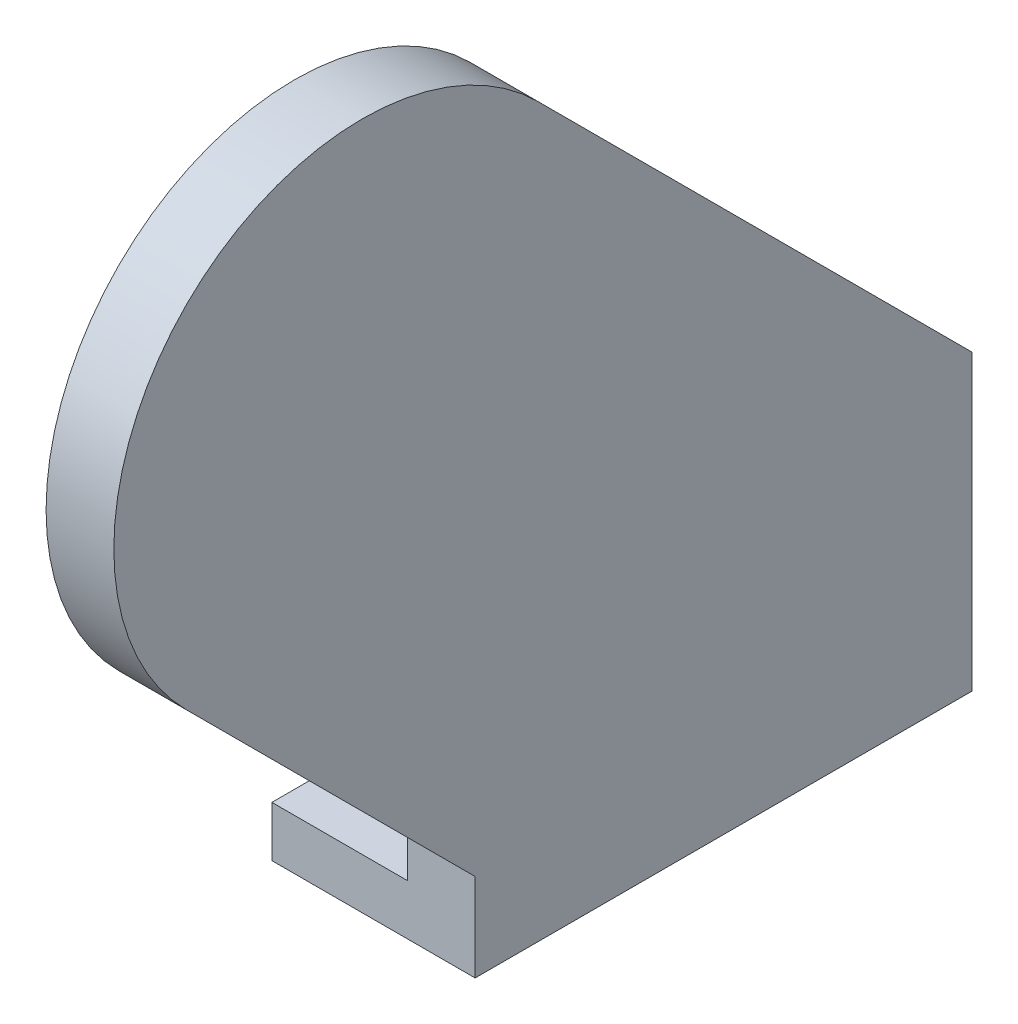
ISO-10303-21;
HEADER;
FILE_DESCRIPTION(('STEP AP214'),'2;1');
FILE_NAME('part.step','',(''),(''),'','','');
FILE_SCHEMA(('AUTOMOTIVE_DESIGN { 1 0 10303 214 1 1 1 1 }'));
ENDSEC;
DATA;
#1=APPLICATION_CONTEXT('core data for automotive mechanical design processes');
#2=APPLICATION_PROTOCOL_DEFINITION('international standard','automotive_design',2000,#1);
#3=PRODUCT_CONTEXT('',#1,'mechanical');
#4=PRODUCT('Part','Part','',(#3));
#5=PRODUCT_RELATED_PRODUCT_CATEGORY('part','',(#4));
#6=PRODUCT_DEFINITION_FORMATION('','',#4);
#7=PRODUCT_DEFINITION_CONTEXT('part definition',#1,'design');
#8=PRODUCT_DEFINITION('design','',#6,#7);
#9=PRODUCT_DEFINITION_SHAPE('','',#8);
#10=(LENGTH_UNIT() NAMED_UNIT(*) SI_UNIT(.MILLI.,.METRE.));
#11=(NAMED_UNIT(*) PLANE_ANGLE_UNIT() SI_UNIT($,.RADIAN.));
#12=(NAMED_UNIT(*) SI_UNIT($,.STERADIAN.) SOLID_ANGLE_UNIT());
#13=UNCERTAINTY_MEASURE_WITH_UNIT(LENGTH_MEASURE(1.E-05),#10,'distance_accuracy_value','');
#14=(GEOMETRIC_REPRESENTATION_CONTEXT(3) GLOBAL_UNCERTAINTY_ASSIGNED_CONTEXT((#13)) GLOBAL_UNIT_ASSIGNED_CONTEXT((#10,
#11,#12)) REPRESENTATION_CONTEXT('',''));
#15=CARTESIAN_POINT('',(0.,0.,0.));
#16=DIRECTION('',(0.,0.,1.));
#17=DIRECTION('',(1.,0.,0.));
#18=AXIS2_PLACEMENT_3D('',#15,#16,#17);
#19=CARTESIAN_POINT('',(61.5,-16.072077939,-4.828427125));
#20=DIRECTION('',(0.,-0.707106781186547,0.707106781186547));
#21=DIRECTION('',(0.,0.707106781186547,0.707106781186547));
#22=AXIS2_PLACEMENT_3D('',#19,#20,#21);
#23=PLANE('',#22);
#24=DIRECTION('',(0.,0.707106781186547,0.707106781186547));
#25=VECTOR('',#24,1.);
#26=CARTESIAN_POINT('',(58.5,-16.072077939,-4.828427125));
#27=LINE('',#26,#25);
#28=CARTESIAN_POINT('',(58.5,-17.243650814,-6.));
#29=VERTEX_POINT('',#28);
#30=CARTESIAN_POINT('',(58.5,1.97817459217873,13.2218254061267));
#31=VERTEX_POINT('',#30);
#32=EDGE_CURVE('E92',#29,#31,#27,.T.);
#33=ORIENTED_EDGE('',*,*,#32,.T.);
#34=DIRECTION('',(-1.,0.,0.));
#35=VECTOR('',#34,1.);
#36=CARTESIAN_POINT('',(60.,1.97817459135746,13.2218254052534));
#37=LINE('',#36,#35);
#38=CARTESIAN_POINT('',(61.5,1.97817459355712,13.2218254061735));
#39=VERTEX_POINT('',#38);
#40=EDGE_CURVE('E255',#31,#39,#37,.F.);
#41=ORIENTED_EDGE('',*,*,#40,.T.);
#42=DIRECTION('',(0.,0.707106781056989,0.707106781316107));
#43=VECTOR('',#42,1.);
#44=CARTESIAN_POINT('',(61.5,-16.0720779385982,-4.828427133876));
#45=LINE('',#44,#43);
#46=CARTESIAN_POINT('',(61.5,-17.243650814,-6.));
#47=VERTEX_POINT('',#46);
#48=EDGE_CURVE('E254',#47,#39,#45,.T.);
#49=ORIENTED_EDGE('',*,*,#48,.F.);
#50=DIRECTION('',(-1.,0.,0.));
#51=VECTOR('',#50,1.);
#52=CARTESIAN_POINT('',(52.5,-17.243650814,-6.));
#53=LINE('',#52,#51);
#54=EDGE_CURVE('E109',#47,#29,#53,.T.);
#55=ORIENTED_EDGE('',*,*,#54,.T.);
#56=EDGE_LOOP('',(#33,#41,#49,#55));
#57=FACE_BOUND('',#56,.T.);
#58=ADVANCED_FACE('F19',(#57),#23,.F.);
#59=CARTESIAN_POINT('',(61.5,-5.8,21.));
#60=DIRECTION('',(-1.,0.,0.));
#61=DIRECTION('',(0.,-1.,0.));
#62=AXIS2_PLACEMENT_3D('',#59,#60,#61);
#63=CYLINDRICAL_SURFACE('',#62,11.);
#64=ORIENTED_EDGE('',*,*,#40,.F.);
#65=CARTESIAN_POINT('',(58.5,-5.8,21.));
#66=DIRECTION('',(-1.,0.,0.));
#67=DIRECTION('',(0.,-1.,0.));
#68=AXIS2_PLACEMENT_3D('',#65,#66,#67);
#69=CIRCLE('',#68,11.);
#70=CARTESIAN_POINT('',(58.5,-13.578174593,28.778174593));
#71=VERTEX_POINT('',#70);
#72=EDGE_CURVE('E229',#31,#71,#69,.F.);
#73=ORIENTED_EDGE('',*,*,#72,.T.);
#74=DIRECTION('',(1.,0.,0.));
#75=VECTOR('',#74,1.);
#76=CARTESIAN_POINT('',(60.,-13.578174593,28.778174593));
#77=LINE('',#76,#75);
#78=CARTESIAN_POINT('',(61.5,-13.5781745834232,28.7781745877387));
#79=VERTEX_POINT('',#78);
#80=EDGE_CURVE('E248',#71,#79,#77,.T.);
#81=ORIENTED_EDGE('',*,*,#80,.T.);
#82=CARTESIAN_POINT('',(61.5,-5.8,21.));
#83=DIRECTION('',(-1.,0.,0.));
#84=DIRECTION('',(0.,-1.,0.));
#85=AXIS2_PLACEMENT_3D('',#82,#83,#84);
#86=CIRCLE('',#85,11.);
#87=EDGE_CURVE('E236',#39,#79,#86,.F.);
#88=ORIENTED_EDGE('',*,*,#87,.F.);
#89=EDGE_LOOP('',(#64,#73,#81,#88));
#90=FACE_BOUND('',#89,.T.);
#91=ADVANCED_FACE('F296',(#90),#63,.T.);
#92=CARTESIAN_POINT('',(61.5,-13.578174593,28.778174593));
#93=DIRECTION('',(0.,0.707106781186548,-0.707106781186547));
#94=DIRECTION('',(0.,-0.707106781186547,-0.707106781186548));
#95=AXIS2_PLACEMENT_3D('',#92,#93,#94);
#96=PLANE('',#95);
#97=DIRECTION('',(0.,-0.707106781186547,-0.707106781186548));
#98=VECTOR('',#97,1.);
#99=CARTESIAN_POINT('',(58.5,-13.578174593,28.778174593));
#100=LINE('',#99,#98);
#101=CARTESIAN_POINT('',(58.5,-26.356349186,16.));
#102=VERTEX_POINT('',#101);
#103=EDGE_CURVE('E42',#71,#102,#100,.T.);
#104=ORIENTED_EDGE('',*,*,#103,.T.);
#105=DIRECTION('',(1.,0.,0.));
#106=VECTOR('',#105,1.);
#107=CARTESIAN_POINT('',(61.5,-26.356349186,16.));
#108=LINE('',#107,#106);
#109=CARTESIAN_POINT('',(61.5,-26.356349186,16.));
#110=VERTEX_POINT('',#109);
#111=EDGE_CURVE('E12',#110,#102,#108,.F.);
#112=ORIENTED_EDGE('',*,*,#111,.F.);
#113=DIRECTION('',(0.,-0.70710678157887,-0.707106780794225));
#114=VECTOR('',#113,1.);
#115=CARTESIAN_POINT('',(61.5,-13.5781745778557,28.778174578468));
#116=LINE('',#115,#114);
#117=EDGE_CURVE('E230',#79,#110,#116,.T.);
#118=ORIENTED_EDGE('',*,*,#117,.F.);
#119=ORIENTED_EDGE('',*,*,#80,.F.);
#120=EDGE_LOOP('',(#104,#112,#118,#119));
#121=FACE_BOUND('',#120,.T.);
#122=ADVANCED_FACE('F286',(#121),#96,.F.);
#123=CARTESIAN_POINT('',(61.5,5.412696938,32.228));
#124=DIRECTION('',(1.,0.,0.));
#125=DIRECTION('',(0.,-1.,0.));
#126=AXIS2_PLACEMENT_3D('',#123,#124,#125);
#127=PLANE('',#126);
#128=ORIENTED_EDGE('',*,*,#87,.T.);
#129=ORIENTED_EDGE('',*,*,#117,.T.);
#130=DIRECTION('',(0.,1.,0.));
#131=VECTOR('',#130,1.);
#132=CARTESIAN_POINT('',(61.5,-29.1313465895,16.));
#133=LINE('',#132,#131);
#134=CARTESIAN_POINT('',(61.5,-30.249489743,15.9999999999713));
#135=VERTEX_POINT('',#134);
#136=EDGE_CURVE('E34',#135,#110,#133,.T.);
#137=ORIENTED_EDGE('',*,*,#136,.F.);
#138=DIRECTION('',(0.,0.,1.));
#139=VECTOR('',#138,1.);
#140=CARTESIAN_POINT('',(61.5,-30.249489743,5.));
#141=LINE('',#140,#139);
#142=CARTESIAN_POINT('',(61.5,-30.249489743,-6.));
#143=VERTEX_POINT('',#142);
#144=EDGE_CURVE('E188',#143,#135,#141,.T.);
#145=ORIENTED_EDGE('',*,*,#144,.F.);
#146=DIRECTION('',(0.,-1.,0.));
#147=VECTOR('',#146,1.);
#148=CARTESIAN_POINT('',(61.5,-24.574997403,-6.));
#149=LINE('',#148,#147);
#150=EDGE_CURVE('E179',#47,#143,#149,.T.);
#151=ORIENTED_EDGE('',*,*,#150,.F.);
#152=ORIENTED_EDGE('',*,*,#48,.T.);
#153=EDGE_LOOP('',(#128,#129,#137,#145,#151,#152));
#154=FACE_BOUND('',#153,.T.);
#155=ADVANCED_FACE('F288',(#154),#127,.T.);
#156=CARTESIAN_POINT('',(61.5,-30.249489743,16.));
#157=DIRECTION('',(0.,0.,1.));
#158=DIRECTION('',(0.,1.,0.));
#159=AXIS2_PLACEMENT_3D('',#156,#157,#158);
#160=PLANE('',#159);
#161=DIRECTION('',(-1.,0.,0.));
#162=VECTOR('',#161,1.);
#163=CARTESIAN_POINT('',(57.,-30.249489743,16.));
#164=LINE('',#163,#162);
#165=CARTESIAN_POINT('',(52.5,-30.249489743,16.));
#166=VERTEX_POINT('',#165);
#167=EDGE_CURVE('E98',#135,#166,#164,.T.);
#168=ORIENTED_EDGE('',*,*,#167,.F.);
#169=ORIENTED_EDGE('',*,*,#136,.T.);
#170=ORIENTED_EDGE('',*,*,#111,.T.);
#171=DIRECTION('',(0.,1.,0.));
#172=VECTOR('',#171,1.);
#173=CARTESIAN_POINT('',(58.5,-30.249489743,16.));
#174=LINE('',#173,#172);
#175=CARTESIAN_POINT('',(58.5000000015,-28.013203436,16.0000000001741));
#176=VERTEX_POINT('',#175);
#177=EDGE_CURVE('E28',#176,#102,#174,.T.);
#178=ORIENTED_EDGE('',*,*,#177,.F.);
#179=DIRECTION('',(-1.,0.,0.));
#180=VECTOR('',#179,1.);
#181=CARTESIAN_POINT('',(55.5,-28.013203436,16.));
#182=LINE('',#181,#180);
#183=CARTESIAN_POINT('',(52.5,-28.013203436,16.));
#184=VERTEX_POINT('',#183);
#185=EDGE_CURVE('E107',#176,#184,#182,.T.);
#186=ORIENTED_EDGE('',*,*,#185,.T.);
#187=DIRECTION('',(0.,-1.,0.));
#188=VECTOR('',#187,1.);
#189=CARTESIAN_POINT('',(52.5,-29.1313465895,16.));
#190=LINE('',#189,#188);
#191=EDGE_CURVE('E185',#184,#166,#190,.T.);
#192=ORIENTED_EDGE('',*,*,#191,.T.);
#193=EDGE_LOOP('',(#168,#169,#170,#178,#186,#192));
#194=FACE_BOUND('',#193,.T.);
#195=ADVANCED_FACE('F283',(#194),#160,.T.);
#196=CARTESIAN_POINT('',(52.5,-30.249489743,16.));
#197=DIRECTION('',(1.,0.,0.));
#198=DIRECTION('',(0.,0.,-1.));
#199=AXIS2_PLACEMENT_3D('',#196,#197,#198);
#200=PLANE('',#199);
#201=DIRECTION('',(0.,1.,0.));
#202=VECTOR('',#201,1.);
#203=CARTESIAN_POINT('',(52.5,-24.574997403,-6.));
#204=LINE('',#203,#202);
#205=CARTESIAN_POINT('',(52.5,-30.249489743,-6.));
#206=VERTEX_POINT('',#205);
#207=CARTESIAN_POINT('',(52.5,-28.013203436,-6.));
#208=VERTEX_POINT('',#207);
#209=EDGE_CURVE('E114',#206,#208,#204,.T.);
#210=ORIENTED_EDGE('',*,*,#209,.F.);
#211=DIRECTION('',(0.,0.,-1.));
#212=VECTOR('',#211,1.);
#213=CARTESIAN_POINT('',(52.5,-30.249489743,5.));
#214=LINE('',#213,#212);
#215=EDGE_CURVE('E510',#166,#206,#214,.T.);
#216=ORIENTED_EDGE('',*,*,#215,.F.);
#217=ORIENTED_EDGE('',*,*,#191,.F.);
#218=DIRECTION('',(0.,0.,-1.));
#219=VECTOR('',#218,1.);
#220=CARTESIAN_POINT('',(52.5,-28.013203436,5.));
#221=LINE('',#220,#219);
#222=EDGE_CURVE('E116',#184,#208,#221,.T.);
#223=ORIENTED_EDGE('',*,*,#222,.T.);
#224=EDGE_LOOP('',(#210,#216,#217,#223));
#225=FACE_BOUND('',#224,.T.);
#226=ADVANCED_FACE('F404',(#225),#200,.F.);
#227=CARTESIAN_POINT('',(52.5,-18.900505063,-6.));
#228=DIRECTION('',(0.,0.,-1.));
#229=DIRECTION('',(1.,0.,0.));
#230=AXIS2_PLACEMENT_3D('',#227,#228,#229);
#231=PLANE('',#230);
#232=ORIENTED_EDGE('',*,*,#209,.T.);
#233=DIRECTION('',(1.,0.,0.));
#234=VECTOR('',#233,1.);
#235=CARTESIAN_POINT('',(55.5,-28.013203436,-6.));
#236=LINE('',#235,#234);
#237=CARTESIAN_POINT('',(58.5,-28.013203436,-6.));
#238=VERTEX_POINT('',#237);
#239=EDGE_CURVE('E104',#208,#238,#236,.T.);
#240=ORIENTED_EDGE('',*,*,#239,.T.);
#241=DIRECTION('',(0.,1.,0.));
#242=VECTOR('',#241,1.);
#243=CARTESIAN_POINT('',(58.5,-11.3069621075,-6.));
#244=LINE('',#243,#242);
#245=EDGE_CURVE('E85',#238,#29,#244,.T.);
#246=ORIENTED_EDGE('',*,*,#245,.T.);
#247=ORIENTED_EDGE('',*,*,#54,.F.);
#248=ORIENTED_EDGE('',*,*,#150,.T.);
#249=DIRECTION('',(1.,0.,0.));
#250=VECTOR('',#249,1.);
#251=CARTESIAN_POINT('',(57.,-30.249489743,-6.));
#252=LINE('',#251,#250);
#253=EDGE_CURVE('E177',#206,#143,#252,.T.);
#254=ORIENTED_EDGE('',*,*,#253,.F.);
#255=EDGE_LOOP('',(#232,#240,#246,#247,#248,#254));
#256=FACE_BOUND('',#255,.T.);
#257=ADVANCED_FACE('F111',(#256),#231,.T.);
#258=CARTESIAN_POINT('',(58.5,-28.013203436,32.228));
#259=DIRECTION('',(1.,0.,0.));
#260=DIRECTION('',(0.,0.,-1.));
#261=AXIS2_PLACEMENT_3D('',#258,#259,#260);
#262=PLANE('',#261);
#263=DIRECTION('',(0.,0.,1.));
#264=VECTOR('',#263,1.);
#265=CARTESIAN_POINT('',(58.5,-28.013203436,5.));
#266=LINE('',#265,#264);
#267=EDGE_CURVE('E89',#238,#176,#266,.T.);
#268=ORIENTED_EDGE('',*,*,#267,.T.);
#269=ORIENTED_EDGE('',*,*,#177,.T.);
#270=ORIENTED_EDGE('',*,*,#103,.F.);
#271=ORIENTED_EDGE('',*,*,#72,.F.);
#272=ORIENTED_EDGE('',*,*,#32,.F.);
#273=ORIENTED_EDGE('',*,*,#245,.F.);
#274=EDGE_LOOP('',(#268,#269,#270,#271,#272,#273));
#275=FACE_BOUND('',#274,.T.);
#276=ADVANCED_FACE('F87',(#275),#262,.F.);
#277=CARTESIAN_POINT('',(52.5,-30.249489743,16.));
#278=DIRECTION('',(0.,-1.,0.));
#279=DIRECTION('',(0.,0.,-1.));
#280=AXIS2_PLACEMENT_3D('',#277,#278,#279);
#281=PLANE('',#280);
#282=ORIENTED_EDGE('',*,*,#253,.T.);
#283=ORIENTED_EDGE('',*,*,#144,.T.);
#284=ORIENTED_EDGE('',*,*,#167,.T.);
#285=ORIENTED_EDGE('',*,*,#215,.T.);
#286=EDGE_LOOP('',(#282,#283,#284,#285));
#287=FACE_BOUND('',#286,.T.);
#288=ADVANCED_FACE('F436',(#287),#281,.T.);
#289=CARTESIAN_POINT('',(52.5,-28.013203436,16.));
#290=DIRECTION('',(0.,-1.,0.));
#291=DIRECTION('',(0.,0.,-1.));
#292=AXIS2_PLACEMENT_3D('',#289,#290,#291);
#293=PLANE('',#292);
#294=ORIENTED_EDGE('',*,*,#239,.F.);
#295=ORIENTED_EDGE('',*,*,#222,.F.);
#296=ORIENTED_EDGE('',*,*,#185,.F.);
#297=ORIENTED_EDGE('',*,*,#267,.F.);
#298=EDGE_LOOP('',(#294,#295,#296,#297));
#299=FACE_BOUND('',#298,.T.);
#300=ADVANCED_FACE('F21',(#299),#293,.F.);
#301=CLOSED_SHELL('',(#58,#91,#122,#155,#195,#226,#257,#276,#288,#300));
#302=MANIFOLD_SOLID_BREP('B1',#301);
#303=ADVANCED_BREP_SHAPE_REPRESENTATION('',(#18,#302),#14);
#304=SHAPE_DEFINITION_REPRESENTATION(#9,#303);
ENDSEC;
END-ISO-10303-21;
